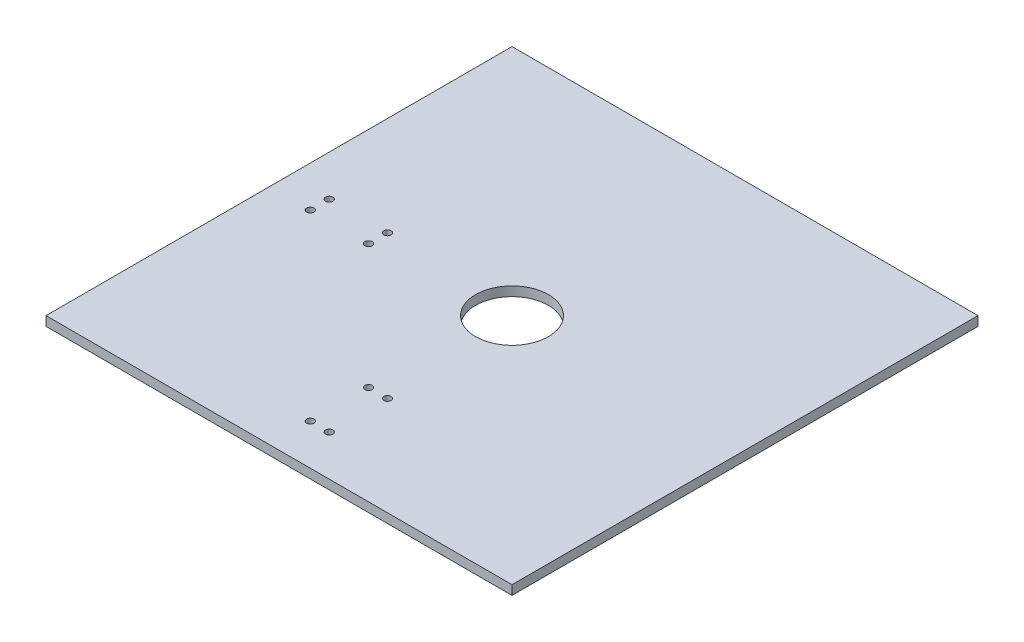
ISO-10303-21;
HEADER;
FILE_DESCRIPTION(('STEP AP214'),'2;1');
FILE_NAME('part.step','',(''),(''),'','','');
FILE_SCHEMA(('AUTOMOTIVE_DESIGN { 1 0 10303 214 1 1 1 1 }'));
ENDSEC;
DATA;
#1=APPLICATION_CONTEXT('core data for automotive mechanical design processes');
#2=APPLICATION_PROTOCOL_DEFINITION('international standard','automotive_design',2000,#1);
#3=PRODUCT_CONTEXT('',#1,'mechanical');
#4=PRODUCT('Part','Part','',(#3));
#5=PRODUCT_RELATED_PRODUCT_CATEGORY('part','',(#4));
#6=PRODUCT_DEFINITION_FORMATION('','',#4);
#7=PRODUCT_DEFINITION_CONTEXT('part definition',#1,'design');
#8=PRODUCT_DEFINITION('design','',#6,#7);
#9=PRODUCT_DEFINITION_SHAPE('','',#8);
#10=(LENGTH_UNIT() NAMED_UNIT(*) SI_UNIT(.MILLI.,.METRE.));
#11=(NAMED_UNIT(*) PLANE_ANGLE_UNIT() SI_UNIT($,.RADIAN.));
#12=(NAMED_UNIT(*) SI_UNIT($,.STERADIAN.) SOLID_ANGLE_UNIT());
#13=UNCERTAINTY_MEASURE_WITH_UNIT(LENGTH_MEASURE(1.E-05),#10,'distance_accuracy_value','');
#14=(GEOMETRIC_REPRESENTATION_CONTEXT(3) GLOBAL_UNCERTAINTY_ASSIGNED_CONTEXT((#13)) GLOBAL_UNIT_ASSIGNED_CONTEXT((#10,
#11,#12)) REPRESENTATION_CONTEXT('',''));
#15=CARTESIAN_POINT('',(0.,0.,0.));
#16=DIRECTION('',(0.,0.,1.));
#17=DIRECTION('',(1.,0.,0.));
#18=AXIS2_PLACEMENT_3D('',#15,#16,#17);
#19=CARTESIAN_POINT('',(101.6,4.064,101.6));
#20=DIRECTION('',(-1.,0.,0.));
#21=DIRECTION('',(0.,0.,1.));
#22=AXIS2_PLACEMENT_3D('',#19,#20,#21);
#23=PLANE('',#22);
#24=DIRECTION('',(0.,0.,-1.));
#25=VECTOR('',#24,1.);
#26=CARTESIAN_POINT('',(101.6,0.,101.6));
#27=LINE('',#26,#25);
#28=CARTESIAN_POINT('',(101.6,0.,101.6));
#29=VERTEX_POINT('',#28);
#30=CARTESIAN_POINT('',(101.6,0.,-101.6));
#31=VERTEX_POINT('',#30);
#32=EDGE_CURVE('E99',#29,#31,#27,.T.);
#33=ORIENTED_EDGE('',*,*,#32,.T.);
#34=DIRECTION('',(0.,-1.,0.));
#35=VECTOR('',#34,1.);
#36=CARTESIAN_POINT('',(101.6,4.064,-101.6));
#37=LINE('',#36,#35);
#38=CARTESIAN_POINT('',(101.6,4.064,-101.6));
#39=VERTEX_POINT('',#38);
#40=EDGE_CURVE('E11',#39,#31,#37,.T.);
#41=ORIENTED_EDGE('',*,*,#40,.F.);
#42=DIRECTION('',(0.,0.,-1.));
#43=VECTOR('',#42,1.);
#44=CARTESIAN_POINT('',(101.6,4.064,101.6));
#45=LINE('',#44,#43);
#46=CARTESIAN_POINT('',(101.6,4.064,101.6));
#47=VERTEX_POINT('',#46);
#48=EDGE_CURVE('E86',#47,#39,#45,.T.);
#49=ORIENTED_EDGE('',*,*,#48,.F.);
#50=DIRECTION('',(0.,-1.,0.));
#51=VECTOR('',#50,1.);
#52=CARTESIAN_POINT('',(101.6,4.064,101.6));
#53=LINE('',#52,#51);
#54=EDGE_CURVE('E95',#47,#29,#53,.T.);
#55=ORIENTED_EDGE('',*,*,#54,.T.);
#56=EDGE_LOOP('',(#33,#41,#49,#55));
#57=FACE_BOUND('',#56,.T.);
#58=ADVANCED_FACE('F33',(#57),#23,.F.);
#59=CARTESIAN_POINT('',(-101.6,4.064,-101.6));
#60=DIRECTION('',(0.,0.,1.));
#61=DIRECTION('',(1.,0.,0.));
#62=AXIS2_PLACEMENT_3D('',#59,#60,#61);
#63=PLANE('',#62);
#64=DIRECTION('',(-1.,0.,0.));
#65=VECTOR('',#64,1.);
#66=CARTESIAN_POINT('',(-101.6,0.,-101.6));
#67=LINE('',#66,#65);
#68=CARTESIAN_POINT('',(-101.6,0.,-101.6));
#69=VERTEX_POINT('',#68);
#70=EDGE_CURVE('E90',#31,#69,#67,.T.);
#71=ORIENTED_EDGE('',*,*,#70,.T.);
#72=DIRECTION('',(0.,-1.,0.));
#73=VECTOR('',#72,1.);
#74=CARTESIAN_POINT('',(-101.6,4.064,-101.6));
#75=LINE('',#74,#73);
#76=CARTESIAN_POINT('',(-101.6,4.064,-101.6));
#77=VERTEX_POINT('',#76);
#78=EDGE_CURVE('E42',#77,#69,#75,.T.);
#79=ORIENTED_EDGE('',*,*,#78,.F.);
#80=DIRECTION('',(-1.,0.,0.));
#81=VECTOR('',#80,1.);
#82=CARTESIAN_POINT('',(-101.6,4.064,-101.6));
#83=LINE('',#82,#81);
#84=EDGE_CURVE('E81',#39,#77,#83,.T.);
#85=ORIENTED_EDGE('',*,*,#84,.F.);
#86=ORIENTED_EDGE('',*,*,#40,.T.);
#87=EDGE_LOOP('',(#71,#79,#85,#86));
#88=FACE_BOUND('',#87,.T.);
#89=ADVANCED_FACE('F89',(#88),#63,.F.);
#90=CARTESIAN_POINT('',(-101.6,4.064,101.6));
#91=DIRECTION('',(1.,0.,0.));
#92=DIRECTION('',(0.,0.,-1.));
#93=AXIS2_PLACEMENT_3D('',#90,#91,#92);
#94=PLANE('',#93);
#95=DIRECTION('',(0.,0.,1.));
#96=VECTOR('',#95,1.);
#97=CARTESIAN_POINT('',(-101.6,0.,101.6));
#98=LINE('',#97,#96);
#99=CARTESIAN_POINT('',(-101.6,0.,101.6));
#100=VERTEX_POINT('',#99);
#101=EDGE_CURVE('E68',#69,#100,#98,.T.);
#102=ORIENTED_EDGE('',*,*,#101,.T.);
#103=DIRECTION('',(0.,-1.,0.));
#104=VECTOR('',#103,1.);
#105=CARTESIAN_POINT('',(-101.6,4.064,101.6));
#106=LINE('',#105,#104);
#107=CARTESIAN_POINT('',(-101.6,4.064,101.6));
#108=VERTEX_POINT('',#107);
#109=EDGE_CURVE('E91',#108,#100,#106,.T.);
#110=ORIENTED_EDGE('',*,*,#109,.F.);
#111=DIRECTION('',(0.,0.,1.));
#112=VECTOR('',#111,1.);
#113=CARTESIAN_POINT('',(-101.6,4.064,101.6));
#114=LINE('',#113,#112);
#115=EDGE_CURVE('E84',#77,#108,#114,.T.);
#116=ORIENTED_EDGE('',*,*,#115,.F.);
#117=ORIENTED_EDGE('',*,*,#78,.T.);
#118=EDGE_LOOP('',(#102,#110,#116,#117));
#119=FACE_BOUND('',#118,.T.);
#120=ADVANCED_FACE('F93',(#119),#94,.F.);
#121=CARTESIAN_POINT('',(-101.6,4.064,101.6));
#122=DIRECTION('',(0.,0.,-1.));
#123=DIRECTION('',(-1.,0.,0.));
#124=AXIS2_PLACEMENT_3D('',#121,#122,#123);
#125=PLANE('',#124);
#126=DIRECTION('',(1.,0.,0.));
#127=VECTOR('',#126,1.);
#128=CARTESIAN_POINT('',(-101.6,0.,101.6));
#129=LINE('',#128,#127);
#130=EDGE_CURVE('E74',#100,#29,#129,.T.);
#131=ORIENTED_EDGE('',*,*,#130,.T.);
#132=ORIENTED_EDGE('',*,*,#54,.F.);
#133=DIRECTION('',(1.,0.,0.));
#134=VECTOR('',#133,1.);
#135=CARTESIAN_POINT('',(-101.6,4.064,101.6));
#136=LINE('',#135,#134);
#137=EDGE_CURVE('E51',#108,#47,#136,.T.);
#138=ORIENTED_EDGE('',*,*,#137,.F.);
#139=ORIENTED_EDGE('',*,*,#109,.T.);
#140=EDGE_LOOP('',(#131,#132,#138,#139));
#141=FACE_BOUND('',#140,.T.);
#142=ADVANCED_FACE('F167',(#141),#125,.F.);
#143=CARTESIAN_POINT('',(0.,4.064,0.));
#144=DIRECTION('',(0.,-1.,0.));
#145=DIRECTION('',(0.,0.,-1.));
#146=AXIS2_PLACEMENT_3D('',#143,#144,#145);
#147=PLANE('',#146);
#148=CARTESIAN_POINT('',(0.,4.064,0.));
#149=DIRECTION('',(0.,1.,0.));
#150=DIRECTION('',(0.,0.,1.));
#151=AXIS2_PLACEMENT_3D('',#148,#149,#150);
#152=CIRCLE('',#151,15.875);
#153=CARTESIAN_POINT('',(0.,4.064,15.875));
#154=VERTEX_POINT('',#153);
#155=EDGE_CURVE('E300',#154,#154,#152,.T.);
#156=ORIENTED_EDGE('',*,*,#155,.F.);
#157=EDGE_LOOP('',(#156));
#158=FACE_BOUND('',#157,.T.);
#159=CARTESIAN_POINT('',(-83.82,4.064,-4.12750000000005));
#160=DIRECTION('',(0.,1.,0.));
#161=DIRECTION('',(0.,0.,1.));
#162=AXIS2_PLACEMENT_3D('',#159,#160,#161);
#163=CIRCLE('',#162,1.58749999999999);
#164=CARTESIAN_POINT('',(-83.82,4.064,-2.54000000000006));
#165=VERTEX_POINT('',#164);
#166=EDGE_CURVE('E128',#165,#165,#163,.T.);
#167=ORIENTED_EDGE('',*,*,#166,.F.);
#168=EDGE_LOOP('',(#167));
#169=FACE_BOUND('',#168,.T.);
#170=CARTESIAN_POINT('',(-58.4199999999999,4.064,-4.12750000000005));
#171=DIRECTION('',(0.,1.,0.));
#172=DIRECTION('',(0.,0.,1.));
#173=AXIS2_PLACEMENT_3D('',#170,#171,#172);
#174=CIRCLE('',#173,1.5875);
#175=CARTESIAN_POINT('',(-58.4199999999999,4.064,-2.54000000000005));
#176=VERTEX_POINT('',#175);
#177=EDGE_CURVE('E118',#176,#176,#174,.T.);
#178=ORIENTED_EDGE('',*,*,#177,.F.);
#179=EDGE_LOOP('',(#178));
#180=FACE_BOUND('',#179,.T.);
#181=CARTESIAN_POINT('',(-58.4199999999999,4.064,4.12749999999995));
#182=DIRECTION('',(0.,1.,0.));
#183=DIRECTION('',(0.,0.,1.));
#184=AXIS2_PLACEMENT_3D('',#181,#182,#183);
#185=CIRCLE('',#184,1.5875);
#186=CARTESIAN_POINT('',(-58.4199999999999,4.064,5.71499999999995));
#187=VERTEX_POINT('',#186);
#188=EDGE_CURVE('E115',#187,#187,#185,.T.);
#189=ORIENTED_EDGE('',*,*,#188,.F.);
#190=EDGE_LOOP('',(#189));
#191=FACE_BOUND('',#190,.T.);
#192=CARTESIAN_POINT('',(-83.82,4.064,4.12750000000005));
#193=DIRECTION('',(0.,1.,0.));
#194=DIRECTION('',(0.,0.,1.));
#195=AXIS2_PLACEMENT_3D('',#192,#193,#194);
#196=CIRCLE('',#195,1.58749999999999);
#197=CARTESIAN_POINT('',(-83.82,4.064,5.71500000000004));
#198=VERTEX_POINT('',#197);
#199=EDGE_CURVE('E112',#198,#198,#196,.T.);
#200=ORIENTED_EDGE('',*,*,#199,.F.);
#201=EDGE_LOOP('',(#200));
#202=FACE_BOUND('',#201,.T.);
#203=CARTESIAN_POINT('',(-4.12749999999995,4.064,83.82));
#204=DIRECTION('',(0.,1.,0.));
#205=DIRECTION('',(0.,0.,1.));
#206=AXIS2_PLACEMENT_3D('',#203,#204,#205);
#207=CIRCLE('',#206,1.5875);
#208=CARTESIAN_POINT('',(-4.12749999999995,4.064,85.4075));
#209=VERTEX_POINT('',#208);
#210=EDGE_CURVE('E111',#209,#209,#207,.T.);
#211=ORIENTED_EDGE('',*,*,#210,.F.);
#212=EDGE_LOOP('',(#211));
#213=FACE_BOUND('',#212,.T.);
#214=CARTESIAN_POINT('',(-4.12750000000005,4.064,58.42));
#215=DIRECTION('',(0.,1.,0.));
#216=DIRECTION('',(0.,0.,1.));
#217=AXIS2_PLACEMENT_3D('',#214,#215,#216);
#218=CIRCLE('',#217,1.5875);
#219=CARTESIAN_POINT('',(-4.12750000000005,4.064,60.0075));
#220=VERTEX_POINT('',#219);
#221=EDGE_CURVE('E139',#220,#220,#218,.T.);
#222=ORIENTED_EDGE('',*,*,#221,.F.);
#223=EDGE_LOOP('',(#222));
#224=FACE_BOUND('',#223,.T.);
#225=CARTESIAN_POINT('',(4.12749999999995,4.064,58.42));
#226=DIRECTION('',(0.,1.,0.));
#227=DIRECTION('',(0.,0.,1.));
#228=AXIS2_PLACEMENT_3D('',#225,#226,#227);
#229=CIRCLE('',#228,1.5875);
#230=CARTESIAN_POINT('',(4.12749999999995,4.064,60.0075));
#231=VERTEX_POINT('',#230);
#232=EDGE_CURVE('E145',#231,#231,#229,.T.);
#233=ORIENTED_EDGE('',*,*,#232,.F.);
#234=EDGE_LOOP('',(#233));
#235=FACE_BOUND('',#234,.T.);
#236=CARTESIAN_POINT('',(4.12749999999995,4.064,83.82));
#237=DIRECTION('',(0.,1.,0.));
#238=DIRECTION('',(0.,0.,1.));
#239=AXIS2_PLACEMENT_3D('',#236,#237,#238);
#240=CIRCLE('',#239,1.5875);
#241=CARTESIAN_POINT('',(4.12749999999995,4.064,85.4075));
#242=VERTEX_POINT('',#241);
#243=EDGE_CURVE('E151',#242,#242,#240,.T.);
#244=ORIENTED_EDGE('',*,*,#243,.F.);
#245=EDGE_LOOP('',(#244));
#246=FACE_BOUND('',#245,.T.);
#247=ORIENTED_EDGE('',*,*,#48,.T.);
#248=ORIENTED_EDGE('',*,*,#84,.T.);
#249=ORIENTED_EDGE('',*,*,#115,.T.);
#250=ORIENTED_EDGE('',*,*,#137,.T.);
#251=EDGE_LOOP('',(#247,#248,#249,#250));
#252=FACE_BOUND('',#251,.T.);
#253=ADVANCED_FACE('F82',(#158,#169,#180,#191,#202,#213,#224,#235,#246,#252),#147,.F.);
#254=CARTESIAN_POINT('',(0.,0.,0.));
#255=DIRECTION('',(0.,-1.,0.));
#256=DIRECTION('',(0.,0.,-1.));
#257=AXIS2_PLACEMENT_3D('',#254,#255,#256);
#258=PLANE('',#257);
#259=CARTESIAN_POINT('',(0.,0.,0.));
#260=DIRECTION('',(0.,-1.,0.));
#261=DIRECTION('',(0.,0.,-1.));
#262=AXIS2_PLACEMENT_3D('',#259,#260,#261);
#263=CIRCLE('',#262,15.875);
#264=CARTESIAN_POINT('',(0.,0.,-15.875));
#265=VERTEX_POINT('',#264);
#266=EDGE_CURVE('E297',#265,#265,#263,.T.);
#267=ORIENTED_EDGE('',*,*,#266,.F.);
#268=EDGE_LOOP('',(#267));
#269=FACE_BOUND('',#268,.T.);
#270=CARTESIAN_POINT('',(-83.82,0.,-4.12750000000005));
#271=DIRECTION('',(0.,-1.,0.));
#272=DIRECTION('',(0.,0.,-1.));
#273=AXIS2_PLACEMENT_3D('',#270,#271,#272);
#274=CIRCLE('',#273,1.58749999999999);
#275=CARTESIAN_POINT('',(-83.82,0.,-5.71500000000004));
#276=VERTEX_POINT('',#275);
#277=EDGE_CURVE('E36',#276,#276,#274,.T.);
#278=ORIENTED_EDGE('',*,*,#277,.F.);
#279=EDGE_LOOP('',(#278));
#280=FACE_BOUND('',#279,.T.);
#281=CARTESIAN_POINT('',(-58.4199999999999,0.,-4.12750000000005));
#282=DIRECTION('',(0.,-1.,0.));
#283=DIRECTION('',(0.,0.,-1.));
#284=AXIS2_PLACEMENT_3D('',#281,#282,#283);
#285=CIRCLE('',#284,1.5875);
#286=CARTESIAN_POINT('',(-58.4199999999999,0.,-5.71500000000004));
#287=VERTEX_POINT('',#286);
#288=EDGE_CURVE('E116',#287,#287,#285,.T.);
#289=ORIENTED_EDGE('',*,*,#288,.F.);
#290=EDGE_LOOP('',(#289));
#291=FACE_BOUND('',#290,.T.);
#292=CARTESIAN_POINT('',(-58.4199999999999,0.,4.12749999999995));
#293=DIRECTION('',(0.,-1.,0.));
#294=DIRECTION('',(0.,0.,-1.));
#295=AXIS2_PLACEMENT_3D('',#292,#293,#294);
#296=CIRCLE('',#295,1.5875);
#297=CARTESIAN_POINT('',(-58.4199999999999,0.,2.53999999999996));
#298=VERTEX_POINT('',#297);
#299=EDGE_CURVE('E113',#298,#298,#296,.T.);
#300=ORIENTED_EDGE('',*,*,#299,.F.);
#301=EDGE_LOOP('',(#300));
#302=FACE_BOUND('',#301,.T.);
#303=CARTESIAN_POINT('',(-83.82,0.,4.12750000000005));
#304=DIRECTION('',(0.,-1.,0.));
#305=DIRECTION('',(0.,0.,-1.));
#306=AXIS2_PLACEMENT_3D('',#303,#304,#305);
#307=CIRCLE('',#306,1.58749999999999);
#308=CARTESIAN_POINT('',(-83.82,0.,2.54000000000006));
#309=VERTEX_POINT('',#308);
#310=EDGE_CURVE('E108',#309,#309,#307,.T.);
#311=ORIENTED_EDGE('',*,*,#310,.F.);
#312=EDGE_LOOP('',(#311));
#313=FACE_BOUND('',#312,.T.);
#314=CARTESIAN_POINT('',(-4.12749999999995,0.,83.82));
#315=DIRECTION('',(0.,-1.,0.));
#316=DIRECTION('',(0.,0.,-1.));
#317=AXIS2_PLACEMENT_3D('',#314,#315,#316);
#318=CIRCLE('',#317,1.5875);
#319=CARTESIAN_POINT('',(-4.12749999999995,0.,82.2325));
#320=VERTEX_POINT('',#319);
#321=EDGE_CURVE('E136',#320,#320,#318,.T.);
#322=ORIENTED_EDGE('',*,*,#321,.F.);
#323=EDGE_LOOP('',(#322));
#324=FACE_BOUND('',#323,.T.);
#325=CARTESIAN_POINT('',(-4.12750000000005,0.,58.42));
#326=DIRECTION('',(0.,-1.,0.));
#327=DIRECTION('',(0.,0.,-1.));
#328=AXIS2_PLACEMENT_3D('',#325,#326,#327);
#329=CIRCLE('',#328,1.5875);
#330=CARTESIAN_POINT('',(-4.12750000000005,0.,56.8325));
#331=VERTEX_POINT('',#330);
#332=EDGE_CURVE('E142',#331,#331,#329,.T.);
#333=ORIENTED_EDGE('',*,*,#332,.F.);
#334=EDGE_LOOP('',(#333));
#335=FACE_BOUND('',#334,.T.);
#336=CARTESIAN_POINT('',(4.12749999999995,0.,58.42));
#337=DIRECTION('',(0.,-1.,0.));
#338=DIRECTION('',(0.,0.,-1.));
#339=AXIS2_PLACEMENT_3D('',#336,#337,#338);
#340=CIRCLE('',#339,1.5875);
#341=CARTESIAN_POINT('',(4.12749999999995,0.,56.8325));
#342=VERTEX_POINT('',#341);
#343=EDGE_CURVE('E148',#342,#342,#340,.T.);
#344=ORIENTED_EDGE('',*,*,#343,.F.);
#345=EDGE_LOOP('',(#344));
#346=FACE_BOUND('',#345,.T.);
#347=CARTESIAN_POINT('',(4.12749999999995,0.,83.82));
#348=DIRECTION('',(0.,-1.,0.));
#349=DIRECTION('',(0.,0.,-1.));
#350=AXIS2_PLACEMENT_3D('',#347,#348,#349);
#351=CIRCLE('',#350,1.5875);
#352=CARTESIAN_POINT('',(4.12749999999995,0.,82.2325));
#353=VERTEX_POINT('',#352);
#354=EDGE_CURVE('E102',#353,#353,#351,.T.);
#355=ORIENTED_EDGE('',*,*,#354,.F.);
#356=EDGE_LOOP('',(#355));
#357=FACE_BOUND('',#356,.T.);
#358=ORIENTED_EDGE('',*,*,#32,.F.);
#359=ORIENTED_EDGE('',*,*,#130,.F.);
#360=ORIENTED_EDGE('',*,*,#101,.F.);
#361=ORIENTED_EDGE('',*,*,#70,.F.);
#362=EDGE_LOOP('',(#358,#359,#360,#361));
#363=FACE_BOUND('',#362,.T.);
#364=ADVANCED_FACE('F160',(#269,#280,#291,#302,#313,#324,#335,#346,#357,#363),#258,.T.);
#365=CARTESIAN_POINT('',(4.12749999999995,4.064,83.82));
#366=DIRECTION('',(0.,1.,0.));
#367=DIRECTION('',(0.,0.,1.));
#368=AXIS2_PLACEMENT_3D('',#365,#366,#367);
#369=CYLINDRICAL_SURFACE('',#368,1.5875);
#370=ORIENTED_EDGE('',*,*,#354,.T.);
#371=EDGE_LOOP('',(#370));
#372=FACE_BOUND('',#371,.T.);
#373=ORIENTED_EDGE('',*,*,#243,.T.);
#374=EDGE_LOOP('',(#373));
#375=FACE_BOUND('',#374,.T.);
#376=ADVANCED_FACE('F157',(#372,#375),#369,.F.);
#377=CARTESIAN_POINT('',(4.12749999999995,4.064,58.42));
#378=DIRECTION('',(0.,1.,0.));
#379=DIRECTION('',(0.,0.,1.));
#380=AXIS2_PLACEMENT_3D('',#377,#378,#379);
#381=CYLINDRICAL_SURFACE('',#380,1.5875);
#382=ORIENTED_EDGE('',*,*,#343,.T.);
#383=EDGE_LOOP('',(#382));
#384=FACE_BOUND('',#383,.T.);
#385=ORIENTED_EDGE('',*,*,#232,.T.);
#386=EDGE_LOOP('',(#385));
#387=FACE_BOUND('',#386,.T.);
#388=ADVANCED_FACE('F201',(#384,#387),#381,.F.);
#389=CARTESIAN_POINT('',(-4.12750000000005,4.064,58.42));
#390=DIRECTION('',(0.,1.,0.));
#391=DIRECTION('',(0.,0.,1.));
#392=AXIS2_PLACEMENT_3D('',#389,#390,#391);
#393=CYLINDRICAL_SURFACE('',#392,1.5875);
#394=ORIENTED_EDGE('',*,*,#332,.T.);
#395=EDGE_LOOP('',(#394));
#396=FACE_BOUND('',#395,.T.);
#397=ORIENTED_EDGE('',*,*,#221,.T.);
#398=EDGE_LOOP('',(#397));
#399=FACE_BOUND('',#398,.T.);
#400=ADVANCED_FACE('F211',(#396,#399),#393,.F.);
#401=CARTESIAN_POINT('',(-4.12749999999995,4.064,83.82));
#402=DIRECTION('',(0.,1.,0.));
#403=DIRECTION('',(0.,0.,1.));
#404=AXIS2_PLACEMENT_3D('',#401,#402,#403);
#405=CYLINDRICAL_SURFACE('',#404,1.5875);
#406=ORIENTED_EDGE('',*,*,#321,.T.);
#407=EDGE_LOOP('',(#406));
#408=FACE_BOUND('',#407,.T.);
#409=ORIENTED_EDGE('',*,*,#210,.T.);
#410=EDGE_LOOP('',(#409));
#411=FACE_BOUND('',#410,.T.);
#412=ADVANCED_FACE('F221',(#408,#411),#405,.F.);
#413=CARTESIAN_POINT('',(-83.82,4.064,4.12750000000005));
#414=DIRECTION('',(0.,1.,0.));
#415=DIRECTION('',(0.,0.,1.));
#416=AXIS2_PLACEMENT_3D('',#413,#414,#415);
#417=CYLINDRICAL_SURFACE('',#416,1.58749999999999);
#418=ORIENTED_EDGE('',*,*,#310,.T.);
#419=EDGE_LOOP('',(#418));
#420=FACE_BOUND('',#419,.T.);
#421=ORIENTED_EDGE('',*,*,#199,.T.);
#422=EDGE_LOOP('',(#421));
#423=FACE_BOUND('',#422,.T.);
#424=ADVANCED_FACE('F231',(#420,#423),#417,.F.);
#425=CARTESIAN_POINT('',(-58.4199999999999,4.064,4.12749999999995));
#426=DIRECTION('',(0.,1.,0.));
#427=DIRECTION('',(0.,0.,1.));
#428=AXIS2_PLACEMENT_3D('',#425,#426,#427);
#429=CYLINDRICAL_SURFACE('',#428,1.5875);
#430=ORIENTED_EDGE('',*,*,#299,.T.);
#431=EDGE_LOOP('',(#430));
#432=FACE_BOUND('',#431,.T.);
#433=ORIENTED_EDGE('',*,*,#188,.T.);
#434=EDGE_LOOP('',(#433));
#435=FACE_BOUND('',#434,.T.);
#436=ADVANCED_FACE('F241',(#432,#435),#429,.F.);
#437=CARTESIAN_POINT('',(-58.4199999999999,4.064,-4.12750000000005));
#438=DIRECTION('',(0.,1.,0.));
#439=DIRECTION('',(0.,0.,1.));
#440=AXIS2_PLACEMENT_3D('',#437,#438,#439);
#441=CYLINDRICAL_SURFACE('',#440,1.5875);
#442=ORIENTED_EDGE('',*,*,#288,.T.);
#443=EDGE_LOOP('',(#442));
#444=FACE_BOUND('',#443,.T.);
#445=ORIENTED_EDGE('',*,*,#177,.T.);
#446=EDGE_LOOP('',(#445));
#447=FACE_BOUND('',#446,.T.);
#448=ADVANCED_FACE('F251',(#444,#447),#441,.F.);
#449=CARTESIAN_POINT('',(-83.82,4.064,-4.12750000000005));
#450=DIRECTION('',(0.,1.,0.));
#451=DIRECTION('',(0.,0.,1.));
#452=AXIS2_PLACEMENT_3D('',#449,#450,#451);
#453=CYLINDRICAL_SURFACE('',#452,1.58749999999999);
#454=ORIENTED_EDGE('',*,*,#277,.T.);
#455=EDGE_LOOP('',(#454));
#456=FACE_BOUND('',#455,.T.);
#457=ORIENTED_EDGE('',*,*,#166,.T.);
#458=EDGE_LOOP('',(#457));
#459=FACE_BOUND('',#458,.T.);
#460=ADVANCED_FACE('F261',(#456,#459),#453,.F.);
#461=CARTESIAN_POINT('',(0.,4.064,0.));
#462=DIRECTION('',(0.,1.,0.));
#463=DIRECTION('',(0.,0.,1.));
#464=AXIS2_PLACEMENT_3D('',#461,#462,#463);
#465=CYLINDRICAL_SURFACE('',#464,15.875);
#466=ORIENTED_EDGE('',*,*,#266,.T.);
#467=EDGE_LOOP('',(#466));
#468=FACE_BOUND('',#467,.T.);
#469=ORIENTED_EDGE('',*,*,#155,.T.);
#470=EDGE_LOOP('',(#469));
#471=FACE_BOUND('',#470,.T.);
#472=ADVANCED_FACE('F270',(#468,#471),#465,.F.);
#473=CLOSED_SHELL('',(#58,#89,#120,#142,#253,#364,#376,#388,#400,#412,#424,#436,#448,#460,#472));
#474=MANIFOLD_SOLID_BREP('B2',#473);
#475=ADVANCED_BREP_SHAPE_REPRESENTATION('',(#18,#474),#14);
#476=SHAPE_DEFINITION_REPRESENTATION(#9,#475);
ENDSEC;
END-ISO-10303-21;
